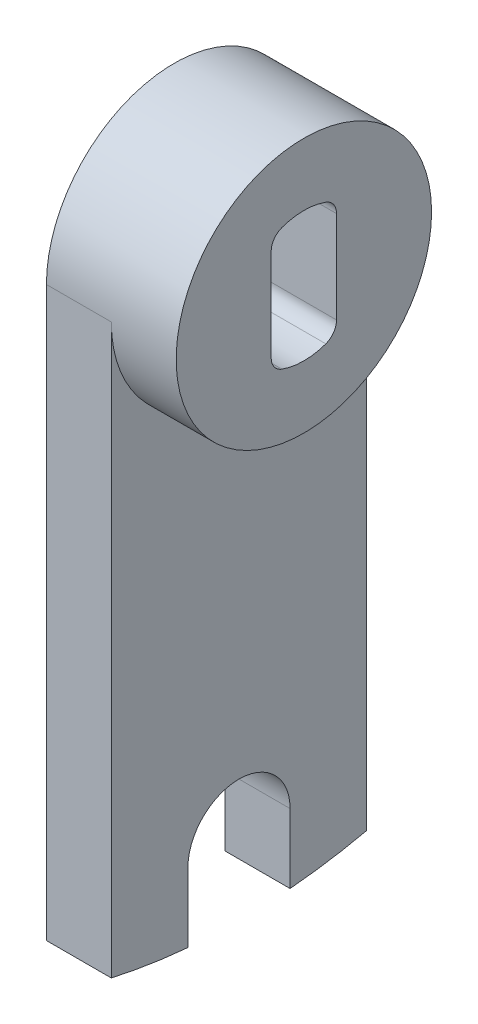
ISO-10303-21;
HEADER;
FILE_DESCRIPTION(('STEP AP214'),'2;1');
FILE_NAME('part.step','',(''),(''),'','','');
FILE_SCHEMA(('AUTOMOTIVE_DESIGN { 1 0 10303 214 1 1 1 1 }'));
ENDSEC;
DATA;
#1=APPLICATION_CONTEXT('core data for automotive mechanical design processes');
#2=APPLICATION_PROTOCOL_DEFINITION('international standard','automotive_design',2000,#1);
#3=PRODUCT_CONTEXT('',#1,'mechanical');
#4=PRODUCT('Part','Part','',(#3));
#5=PRODUCT_RELATED_PRODUCT_CATEGORY('part','',(#4));
#6=PRODUCT_DEFINITION_FORMATION('','',#4);
#7=PRODUCT_DEFINITION_CONTEXT('part definition',#1,'design');
#8=PRODUCT_DEFINITION('design','',#6,#7);
#9=PRODUCT_DEFINITION_SHAPE('','',#8);
#10=(LENGTH_UNIT() NAMED_UNIT(*) SI_UNIT(.MILLI.,.METRE.));
#11=(NAMED_UNIT(*) PLANE_ANGLE_UNIT() SI_UNIT($,.RADIAN.));
#12=(NAMED_UNIT(*) SI_UNIT($,.STERADIAN.) SOLID_ANGLE_UNIT());
#13=UNCERTAINTY_MEASURE_WITH_UNIT(LENGTH_MEASURE(1.E-05),#10,'distance_accuracy_value','');
#14=(GEOMETRIC_REPRESENTATION_CONTEXT(3) GLOBAL_UNCERTAINTY_ASSIGNED_CONTEXT((#13)) GLOBAL_UNIT_ASSIGNED_CONTEXT((#10,
#11,#12)) REPRESENTATION_CONTEXT('',''));
#15=CARTESIAN_POINT('',(0.,0.,0.));
#16=DIRECTION('',(0.,0.,1.));
#17=DIRECTION('',(1.,0.,0.));
#18=AXIS2_PLACEMENT_3D('',#15,#16,#17);
#19=CARTESIAN_POINT('',(3.175,0.,0.));
#20=DIRECTION('',(1.,0.,0.));
#21=DIRECTION('',(0.,0.,-1.));
#22=AXIS2_PLACEMENT_3D('',#19,#20,#21);
#23=PLANE('',#22);
#24=CARTESIAN_POINT('',(3.175,0.,0.));
#25=DIRECTION('',(1.,0.,0.));
#26=DIRECTION('',(0.,0.,-1.));
#27=AXIS2_PLACEMENT_3D('',#24,#25,#26);
#28=CIRCLE('',#27,12.5);
#29=CARTESIAN_POINT('',(3.175,0.,12.5));
#30=VERTEX_POINT('',#29);
#31=CARTESIAN_POINT('',(3.175,0.,-12.5));
#32=VERTEX_POINT('',#31);
#33=EDGE_CURVE('E159',#30,#32,#28,.T.);
#34=ORIENTED_EDGE('',*,*,#33,.F.);
#35=DIRECTION('',(0.,-1.,0.));
#36=VECTOR('',#35,1.);
#37=CARTESIAN_POINT('',(3.175,0.,12.5));
#38=LINE('',#37,#36);
#39=CARTESIAN_POINT('',(3.175,-55.6124985951899,12.5));
#40=VERTEX_POINT('',#39);
#41=EDGE_CURVE('E164',#30,#40,#38,.T.);
#42=ORIENTED_EDGE('',*,*,#41,.T.);
#43=CARTESIAN_POINT('',(3.175,0.,0.));
#44=DIRECTION('',(1.,0.,0.));
#45=DIRECTION('',(0.,0.,-1.));
#46=AXIS2_PLACEMENT_3D('',#43,#44,#45);
#47=CIRCLE('',#46,57.);
#48=CARTESIAN_POINT('',(3.175,-56.7802782663136,4.99999999999999));
#49=VERTEX_POINT('',#48);
#50=EDGE_CURVE('E222',#40,#49,#47,.T.);
#51=ORIENTED_EDGE('',*,*,#50,.T.);
#52=DIRECTION('',(0.,1.,0.));
#53=VECTOR('',#52,1.);
#54=CARTESIAN_POINT('',(3.175,-50.,4.99999999999999));
#55=LINE('',#54,#53);
#56=CARTESIAN_POINT('',(3.175,-50.,4.99999999999999));
#57=VERTEX_POINT('',#56);
#58=EDGE_CURVE('E220',#49,#57,#55,.T.);
#59=ORIENTED_EDGE('',*,*,#58,.T.);
#60=CARTESIAN_POINT('',(3.175,-50.,0.));
#61=DIRECTION('',(-1.,0.,0.));
#62=DIRECTION('',(0.,0.,-1.));
#63=AXIS2_PLACEMENT_3D('',#60,#61,#62);
#64=CIRCLE('',#63,5.);
#65=CARTESIAN_POINT('',(3.175,-50.,-5.));
#66=VERTEX_POINT('',#65);
#67=EDGE_CURVE('E218',#57,#66,#64,.T.);
#68=ORIENTED_EDGE('',*,*,#67,.T.);
#69=DIRECTION('',(0.,-1.,0.));
#70=VECTOR('',#69,1.);
#71=CARTESIAN_POINT('',(3.175,-50.,-5.00000000000001));
#72=LINE('',#71,#70);
#73=CARTESIAN_POINT('',(3.175,-56.7802782663136,-5.00000000000001));
#74=VERTEX_POINT('',#73);
#75=EDGE_CURVE('E199',#66,#74,#72,.T.);
#76=ORIENTED_EDGE('',*,*,#75,.T.);
#77=CARTESIAN_POINT('',(3.175,0.,0.));
#78=DIRECTION('',(1.,0.,0.));
#79=DIRECTION('',(0.,0.,-1.));
#80=AXIS2_PLACEMENT_3D('',#77,#78,#79);
#81=CIRCLE('',#80,57.);
#82=CARTESIAN_POINT('',(3.175,-55.6124985951899,-12.5));
#83=VERTEX_POINT('',#82);
#84=EDGE_CURVE('E162',#74,#83,#81,.T.);
#85=ORIENTED_EDGE('',*,*,#84,.T.);
#86=DIRECTION('',(0.,1.,0.));
#87=VECTOR('',#86,1.);
#88=CARTESIAN_POINT('',(3.175,0.,-12.5));
#89=LINE('',#88,#87);
#90=EDGE_CURVE('E149',#83,#32,#89,.T.);
#91=ORIENTED_EDGE('',*,*,#90,.T.);
#92=EDGE_LOOP('',(#34,#42,#51,#59,#68,#76,#85,#91));
#93=FACE_BOUND('',#92,.T.);
#94=ADVANCED_FACE('F32',(#93),#23,.T.);
#95=CARTESIAN_POINT('',(-3.175,0.,0.));
#96=DIRECTION('',(1.,0.,0.));
#97=DIRECTION('',(0.,0.,-1.));
#98=AXIS2_PLACEMENT_3D('',#95,#96,#97);
#99=PLANE('',#98);
#100=CARTESIAN_POINT('',(-3.175,0.,0.));
#101=DIRECTION('',(1.,0.,0.));
#102=DIRECTION('',(0.,0.,-1.));
#103=AXIS2_PLACEMENT_3D('',#100,#101,#102);
#104=CIRCLE('',#103,57.);
#105=CARTESIAN_POINT('',(-3.175,-56.7802782663136,-5.00000000000001));
#106=VERTEX_POINT('',#105);
#107=CARTESIAN_POINT('',(-3.175,-55.6124985951899,-12.5));
#108=VERTEX_POINT('',#107);
#109=EDGE_CURVE('E213',#106,#108,#104,.T.);
#110=ORIENTED_EDGE('',*,*,#109,.F.);
#111=DIRECTION('',(0.,-1.,0.));
#112=VECTOR('',#111,1.);
#113=CARTESIAN_POINT('',(-3.175,-50.,-5.00000000000001));
#114=LINE('',#113,#112);
#115=CARTESIAN_POINT('',(-3.175,-50.,-5.));
#116=VERTEX_POINT('',#115);
#117=EDGE_CURVE('E200',#116,#106,#114,.T.);
#118=ORIENTED_EDGE('',*,*,#117,.F.);
#119=CARTESIAN_POINT('',(-3.175,-50.,0.));
#120=DIRECTION('',(-1.,0.,0.));
#121=DIRECTION('',(0.,0.,-1.));
#122=AXIS2_PLACEMENT_3D('',#119,#120,#121);
#123=CIRCLE('',#122,5.);
#124=CARTESIAN_POINT('',(-3.175,-50.,4.99999999999999));
#125=VERTEX_POINT('',#124);
#126=EDGE_CURVE('E202',#125,#116,#123,.T.);
#127=ORIENTED_EDGE('',*,*,#126,.F.);
#128=DIRECTION('',(0.,1.,0.));
#129=VECTOR('',#128,1.);
#130=CARTESIAN_POINT('',(-3.175,-50.,4.99999999999999));
#131=LINE('',#130,#129);
#132=CARTESIAN_POINT('',(-3.175,-56.7802782663136,4.99999999999999));
#133=VERTEX_POINT('',#132);
#134=EDGE_CURVE('E204',#133,#125,#131,.T.);
#135=ORIENTED_EDGE('',*,*,#134,.F.);
#136=CARTESIAN_POINT('',(-3.175,0.,0.));
#137=DIRECTION('',(1.,0.,0.));
#138=DIRECTION('',(0.,0.,-1.));
#139=AXIS2_PLACEMENT_3D('',#136,#137,#138);
#140=CIRCLE('',#139,57.);
#141=CARTESIAN_POINT('',(-3.175,-55.6124985951899,12.5));
#142=VERTEX_POINT('',#141);
#143=EDGE_CURVE('E206',#142,#133,#140,.T.);
#144=ORIENTED_EDGE('',*,*,#143,.F.);
#145=DIRECTION('',(0.,-1.,0.));
#146=VECTOR('',#145,1.);
#147=CARTESIAN_POINT('',(-3.175,0.,12.5));
#148=LINE('',#147,#146);
#149=CARTESIAN_POINT('',(-3.175,0.,12.5));
#150=VERTEX_POINT('',#149);
#151=EDGE_CURVE('E208',#150,#142,#148,.T.);
#152=ORIENTED_EDGE('',*,*,#151,.F.);
#153=CARTESIAN_POINT('',(-3.175,0.,0.));
#154=DIRECTION('',(1.,0.,0.));
#155=DIRECTION('',(0.,0.,-1.));
#156=AXIS2_PLACEMENT_3D('',#153,#154,#155);
#157=CIRCLE('',#156,12.5);
#158=CARTESIAN_POINT('',(-3.175,0.,-12.5));
#159=VERTEX_POINT('',#158);
#160=EDGE_CURVE('E210',#159,#150,#157,.T.);
#161=ORIENTED_EDGE('',*,*,#160,.F.);
#162=DIRECTION('',(0.,1.,0.));
#163=VECTOR('',#162,1.);
#164=CARTESIAN_POINT('',(-3.175,0.,-12.5));
#165=LINE('',#164,#163);
#166=EDGE_CURVE('E151',#108,#159,#165,.T.);
#167=ORIENTED_EDGE('',*,*,#166,.F.);
#168=EDGE_LOOP('',(#110,#118,#127,#135,#144,#152,#161,#167));
#169=FACE_BOUND('',#168,.T.);
#170=DIRECTION('',(0.,1.,0.));
#171=VECTOR('',#170,1.);
#172=CARTESIAN_POINT('',(-3.175,5.51390650990747,-3.2004));
#173=LINE('',#172,#171);
#174=CARTESIAN_POINT('',(-3.175,-4.50805279472191,-3.2004));
#175=VERTEX_POINT('',#174);
#176=CARTESIAN_POINT('',(-3.175,4.50805279472191,-3.2004));
#177=VERTEX_POINT('',#176);
#178=EDGE_CURVE('E216',#175,#177,#173,.T.);
#179=ORIENTED_EDGE('',*,*,#178,.T.);
#180=CARTESIAN_POINT('',(-3.175,4.50805279472191,-1.6129));
#181=DIRECTION('',(1.,0.,0.));
#182=DIRECTION('',(0.,0.,-1.));
#183=AXIS2_PLACEMENT_3D('',#180,#181,#182);
#184=CIRCLE('',#183,1.5875);
#185=CARTESIAN_POINT('',(-3.175,6.00276525981538,-2.14768116710875));
#186=VERTEX_POINT('',#185);
#187=EDGE_CURVE('E40',#177,#186,#184,.T.);
#188=ORIENTED_EDGE('',*,*,#187,.T.);
#189=CARTESIAN_POINT('',(-3.175,0.,0.));
#190=DIRECTION('',(1.,0.,0.));
#191=DIRECTION('',(0.,0.,-1.));
#192=AXIS2_PLACEMENT_3D('',#189,#190,#191);
#193=CIRCLE('',#192,6.3754);
#194=CARTESIAN_POINT('',(-3.175,6.00276525981538,2.14768116710875));
#195=VERTEX_POINT('',#194);
#196=EDGE_CURVE('E233',#186,#195,#193,.T.);
#197=ORIENTED_EDGE('',*,*,#196,.T.);
#198=CARTESIAN_POINT('',(-3.175,4.50805279472191,1.6129));
#199=DIRECTION('',(1.,0.,0.));
#200=DIRECTION('',(0.,0.,-1.));
#201=AXIS2_PLACEMENT_3D('',#198,#199,#200);
#202=CIRCLE('',#201,1.5875);
#203=CARTESIAN_POINT('',(-3.175,4.50805279472191,3.2004));
#204=VERTEX_POINT('',#203);
#205=EDGE_CURVE('E257',#195,#204,#202,.T.);
#206=ORIENTED_EDGE('',*,*,#205,.T.);
#207=DIRECTION('',(0.,-1.,0.));
#208=VECTOR('',#207,1.);
#209=CARTESIAN_POINT('',(-3.175,5.51390650990747,3.2004));
#210=LINE('',#209,#208);
#211=CARTESIAN_POINT('',(-3.175,-4.50805279472191,3.2004));
#212=VERTEX_POINT('',#211);
#213=EDGE_CURVE('E230',#204,#212,#210,.T.);
#214=ORIENTED_EDGE('',*,*,#213,.T.);
#215=CARTESIAN_POINT('',(-3.175,-4.50805279472191,1.6129));
#216=DIRECTION('',(1.,0.,0.));
#217=DIRECTION('',(0.,0.,-1.));
#218=AXIS2_PLACEMENT_3D('',#215,#216,#217);
#219=CIRCLE('',#218,1.5875);
#220=CARTESIAN_POINT('',(-3.175,-6.00276525981538,2.14768116710875));
#221=VERTEX_POINT('',#220);
#222=EDGE_CURVE('E258',#212,#221,#219,.T.);
#223=ORIENTED_EDGE('',*,*,#222,.T.);
#224=CARTESIAN_POINT('',(-3.175,0.,0.));
#225=DIRECTION('',(1.,0.,0.));
#226=DIRECTION('',(0.,0.,-1.));
#227=AXIS2_PLACEMENT_3D('',#224,#225,#226);
#228=CIRCLE('',#227,6.3754);
#229=CARTESIAN_POINT('',(-3.175,-6.00276525981538,-2.14768116710875));
#230=VERTEX_POINT('',#229);
#231=EDGE_CURVE('E227',#221,#230,#228,.T.);
#232=ORIENTED_EDGE('',*,*,#231,.T.);
#233=CARTESIAN_POINT('',(-3.175,-4.50805279472191,-1.6129));
#234=DIRECTION('',(1.,0.,0.));
#235=DIRECTION('',(0.,0.,-1.));
#236=AXIS2_PLACEMENT_3D('',#233,#234,#235);
#237=CIRCLE('',#236,1.5875);
#238=EDGE_CURVE('E267',#230,#175,#237,.T.);
#239=ORIENTED_EDGE('',*,*,#238,.T.);
#240=EDGE_LOOP('',(#179,#188,#197,#206,#214,#223,#232,#239));
#241=FACE_BOUND('',#240,.T.);
#242=ADVANCED_FACE('F273',(#169,#241),#99,.F.);
#243=CARTESIAN_POINT('',(3.175,0.,0.));
#244=DIRECTION('',(-1.,0.,0.));
#245=DIRECTION('',(0.,0.,1.));
#246=AXIS2_PLACEMENT_3D('',#243,#244,#245);
#247=CYLINDRICAL_SURFACE('',#246,57.);
#248=ORIENTED_EDGE('',*,*,#109,.T.);
#249=DIRECTION('',(-1.,0.,0.));
#250=VECTOR('',#249,1.);
#251=CARTESIAN_POINT('',(3.175,-55.6124985951899,-12.5));
#252=LINE('',#251,#250);
#253=EDGE_CURVE('E155',#83,#108,#252,.T.);
#254=ORIENTED_EDGE('',*,*,#253,.F.);
#255=ORIENTED_EDGE('',*,*,#84,.F.);
#256=DIRECTION('',(-1.,0.,0.));
#257=VECTOR('',#256,1.);
#258=CARTESIAN_POINT('',(3.175,-56.7802782663136,-5.00000000000001));
#259=LINE('',#258,#257);
#260=EDGE_CURVE('E196',#74,#106,#259,.T.);
#261=ORIENTED_EDGE('',*,*,#260,.T.);
#262=EDGE_LOOP('',(#248,#254,#255,#261));
#263=FACE_BOUND('',#262,.T.);
#264=ADVANCED_FACE('F324',(#263),#247,.T.);
#265=CARTESIAN_POINT('',(3.175,0.,-12.5));
#266=DIRECTION('',(0.,0.,1.));
#267=DIRECTION('',(0.,-1.,0.));
#268=AXIS2_PLACEMENT_3D('',#265,#266,#267);
#269=PLANE('',#268);
#270=ORIENTED_EDGE('',*,*,#166,.T.);
#271=DIRECTION('',(-1.,0.,0.));
#272=VECTOR('',#271,1.);
#273=CARTESIAN_POINT('',(3.175,0.,-12.5));
#274=LINE('',#273,#272);
#275=EDGE_CURVE('E145',#32,#159,#274,.T.);
#276=ORIENTED_EDGE('',*,*,#275,.F.);
#277=ORIENTED_EDGE('',*,*,#90,.F.);
#278=ORIENTED_EDGE('',*,*,#253,.T.);
#279=EDGE_LOOP('',(#270,#276,#277,#278));
#280=FACE_BOUND('',#279,.T.);
#281=ADVANCED_FACE('F147',(#280),#269,.F.);
#282=CARTESIAN_POINT('',(3.175,0.,0.));
#283=DIRECTION('',(-1.,0.,0.));
#284=DIRECTION('',(0.,0.,1.));
#285=AXIS2_PLACEMENT_3D('',#282,#283,#284);
#286=CYLINDRICAL_SURFACE('',#285,12.5);
#287=ORIENTED_EDGE('',*,*,#160,.T.);
#288=DIRECTION('',(-1.,0.,0.));
#289=VECTOR('',#288,1.);
#290=CARTESIAN_POINT('',(3.175,0.,12.5));
#291=LINE('',#290,#289);
#292=EDGE_CURVE('E156',#30,#150,#291,.T.);
#293=ORIENTED_EDGE('',*,*,#292,.F.);
#294=ORIENTED_EDGE('',*,*,#33,.T.);
#295=ORIENTED_EDGE('',*,*,#275,.T.);
#296=EDGE_LOOP('',(#287,#293,#294,#295));
#297=FACE_BOUND('',#296,.T.);
#298=CARTESIAN_POINT('',(9.525,0.,0.));
#299=DIRECTION('',(1.,0.,0.));
#300=DIRECTION('',(0.,0.,-1.));
#301=AXIS2_PLACEMENT_3D('',#298,#299,#300);
#302=CIRCLE('',#301,12.5);
#303=CARTESIAN_POINT('',(9.525,0.,-12.5));
#304=VERTEX_POINT('',#303);
#305=EDGE_CURVE('E236',#304,#304,#302,.T.);
#306=ORIENTED_EDGE('',*,*,#305,.F.);
#307=EDGE_LOOP('',(#306));
#308=FACE_BOUND('',#307,.T.);
#309=ADVANCED_FACE('F166',(#297,#308),#286,.T.);
#310=CARTESIAN_POINT('',(3.175,0.,12.5));
#311=DIRECTION('',(0.,0.,-1.));
#312=DIRECTION('',(0.,1.,0.));
#313=AXIS2_PLACEMENT_3D('',#310,#311,#312);
#314=PLANE('',#313);
#315=ORIENTED_EDGE('',*,*,#151,.T.);
#316=DIRECTION('',(-1.,0.,0.));
#317=VECTOR('',#316,1.);
#318=CARTESIAN_POINT('',(3.175,-55.6124985951899,12.5));
#319=LINE('',#318,#317);
#320=EDGE_CURVE('E184',#40,#142,#319,.T.);
#321=ORIENTED_EDGE('',*,*,#320,.F.);
#322=ORIENTED_EDGE('',*,*,#41,.F.);
#323=ORIENTED_EDGE('',*,*,#292,.T.);
#324=EDGE_LOOP('',(#315,#321,#322,#323));
#325=FACE_BOUND('',#324,.T.);
#326=ADVANCED_FACE('F302',(#325),#314,.F.);
#327=CARTESIAN_POINT('',(3.175,0.,0.));
#328=DIRECTION('',(-1.,0.,0.));
#329=DIRECTION('',(0.,0.,1.));
#330=AXIS2_PLACEMENT_3D('',#327,#328,#329);
#331=CYLINDRICAL_SURFACE('',#330,57.);
#332=ORIENTED_EDGE('',*,*,#143,.T.);
#333=DIRECTION('',(-1.,0.,0.));
#334=VECTOR('',#333,1.);
#335=CARTESIAN_POINT('',(3.175,-56.7802782663136,4.99999999999999));
#336=LINE('',#335,#334);
#337=EDGE_CURVE('E187',#49,#133,#336,.T.);
#338=ORIENTED_EDGE('',*,*,#337,.F.);
#339=ORIENTED_EDGE('',*,*,#50,.F.);
#340=ORIENTED_EDGE('',*,*,#320,.T.);
#341=EDGE_LOOP('',(#332,#338,#339,#340));
#342=FACE_BOUND('',#341,.T.);
#343=ADVANCED_FACE('F306',(#342),#331,.T.);
#344=CARTESIAN_POINT('',(3.175,-50.,4.99999999999999));
#345=DIRECTION('',(0.,0.,1.));
#346=DIRECTION('',(0.,-1.,0.));
#347=AXIS2_PLACEMENT_3D('',#344,#345,#346);
#348=PLANE('',#347);
#349=ORIENTED_EDGE('',*,*,#134,.T.);
#350=DIRECTION('',(-1.,0.,0.));
#351=VECTOR('',#350,1.);
#352=CARTESIAN_POINT('',(3.175,-50.,4.99999999999999));
#353=LINE('',#352,#351);
#354=EDGE_CURVE('E190',#57,#125,#353,.T.);
#355=ORIENTED_EDGE('',*,*,#354,.F.);
#356=ORIENTED_EDGE('',*,*,#58,.F.);
#357=ORIENTED_EDGE('',*,*,#337,.T.);
#358=EDGE_LOOP('',(#349,#355,#356,#357));
#359=FACE_BOUND('',#358,.T.);
#360=ADVANCED_FACE('F311',(#359),#348,.F.);
#361=CARTESIAN_POINT('',(3.175,-50.,0.));
#362=DIRECTION('',(-1.,0.,0.));
#363=DIRECTION('',(0.,0.,1.));
#364=AXIS2_PLACEMENT_3D('',#361,#362,#363);
#365=CYLINDRICAL_SURFACE('',#364,5.);
#366=ORIENTED_EDGE('',*,*,#126,.T.);
#367=DIRECTION('',(-1.,0.,0.));
#368=VECTOR('',#367,1.);
#369=CARTESIAN_POINT('',(3.175,-50.,-5.));
#370=LINE('',#369,#368);
#371=EDGE_CURVE('E193',#66,#116,#370,.T.);
#372=ORIENTED_EDGE('',*,*,#371,.F.);
#373=ORIENTED_EDGE('',*,*,#67,.F.);
#374=ORIENTED_EDGE('',*,*,#354,.T.);
#375=EDGE_LOOP('',(#366,#372,#373,#374));
#376=FACE_BOUND('',#375,.T.);
#377=ADVANCED_FACE('F317',(#376),#365,.F.);
#378=CARTESIAN_POINT('',(3.175,-50.,-5.00000000000001));
#379=DIRECTION('',(0.,0.,-1.));
#380=DIRECTION('',(0.,1.,0.));
#381=AXIS2_PLACEMENT_3D('',#378,#379,#380);
#382=PLANE('',#381);
#383=ORIENTED_EDGE('',*,*,#117,.T.);
#384=ORIENTED_EDGE('',*,*,#260,.F.);
#385=ORIENTED_EDGE('',*,*,#75,.F.);
#386=ORIENTED_EDGE('',*,*,#371,.T.);
#387=EDGE_LOOP('',(#383,#384,#385,#386));
#388=FACE_BOUND('',#387,.T.);
#389=ADVANCED_FACE('F321',(#388),#382,.F.);
#390=CARTESIAN_POINT('',(3.175,0.,0.));
#391=DIRECTION('',(-1.,0.,0.));
#392=DIRECTION('',(0.,0.,1.));
#393=AXIS2_PLACEMENT_3D('',#390,#391,#392);
#394=CYLINDRICAL_SURFACE('',#393,6.3754);
#395=CARTESIAN_POINT('',(9.525,0.,0.));
#396=DIRECTION('',(1.,0.,0.));
#397=DIRECTION('',(0.,0.,-1.));
#398=AXIS2_PLACEMENT_3D('',#395,#396,#397);
#399=CIRCLE('',#398,6.3754);
#400=CARTESIAN_POINT('',(9.525,6.00276525981538,-2.14768116710875));
#401=VERTEX_POINT('',#400);
#402=CARTESIAN_POINT('',(9.525,6.00276525981538,2.14768116710875));
#403=VERTEX_POINT('',#402);
#404=EDGE_CURVE('E248',#401,#403,#399,.T.);
#405=ORIENTED_EDGE('',*,*,#404,.T.);
#406=DIRECTION('',(-1.,0.,0.));
#407=VECTOR('',#406,1.);
#408=CARTESIAN_POINT('',(3.175,6.00276525981538,2.14768116710875));
#409=LINE('',#408,#407);
#410=EDGE_CURVE('E252',#403,#195,#409,.T.);
#411=ORIENTED_EDGE('',*,*,#410,.T.);
#412=ORIENTED_EDGE('',*,*,#196,.F.);
#413=DIRECTION('',(-1.,0.,0.));
#414=VECTOR('',#413,1.);
#415=CARTESIAN_POINT('',(3.175,6.00276525981538,-2.14768116710875));
#416=LINE('',#415,#414);
#417=EDGE_CURVE('E54',#186,#401,#416,.F.);
#418=ORIENTED_EDGE('',*,*,#417,.T.);
#419=EDGE_LOOP('',(#405,#411,#412,#418));
#420=FACE_BOUND('',#419,.T.);
#421=ADVANCED_FACE('F251',(#420),#394,.F.);
#422=CARTESIAN_POINT('',(3.175,5.51390650990747,3.2004));
#423=DIRECTION('',(0.,0.,-1.));
#424=DIRECTION('',(-1.,0.,0.));
#425=AXIS2_PLACEMENT_3D('',#422,#423,#424);
#426=PLANE('',#425);
#427=DIRECTION('',(0.,-1.,0.));
#428=VECTOR('',#427,1.);
#429=CARTESIAN_POINT('',(9.525,5.51390650990747,3.2004));
#430=LINE('',#429,#428);
#431=CARTESIAN_POINT('',(9.525,4.50805279472191,3.2004));
#432=VERTEX_POINT('',#431);
#433=CARTESIAN_POINT('',(9.525,-4.50805279472191,3.2004));
#434=VERTEX_POINT('',#433);
#435=EDGE_CURVE('E245',#432,#434,#430,.T.);
#436=ORIENTED_EDGE('',*,*,#435,.T.);
#437=DIRECTION('',(1.,0.,0.));
#438=VECTOR('',#437,1.);
#439=CARTESIAN_POINT('',(-3.175,-4.50805279472191,3.2004));
#440=LINE('',#439,#438);
#441=EDGE_CURVE('E172',#434,#212,#440,.F.);
#442=ORIENTED_EDGE('',*,*,#441,.T.);
#443=ORIENTED_EDGE('',*,*,#213,.F.);
#444=DIRECTION('',(1.,0.,0.));
#445=VECTOR('',#444,1.);
#446=CARTESIAN_POINT('',(9.525,4.50805279472191,3.2004));
#447=LINE('',#446,#445);
#448=EDGE_CURVE('E170',#204,#432,#447,.T.);
#449=ORIENTED_EDGE('',*,*,#448,.T.);
#450=EDGE_LOOP('',(#436,#442,#443,#449));
#451=FACE_BOUND('',#450,.T.);
#452=ADVANCED_FACE('F406',(#451),#426,.T.);
#453=CARTESIAN_POINT('',(3.175,0.,0.));
#454=DIRECTION('',(-1.,0.,0.));
#455=DIRECTION('',(0.,0.,1.));
#456=AXIS2_PLACEMENT_3D('',#453,#454,#455);
#457=CYLINDRICAL_SURFACE('',#456,6.3754);
#458=ORIENTED_EDGE('',*,*,#231,.F.);
#459=DIRECTION('',(-1.,0.,0.));
#460=VECTOR('',#459,1.);
#461=CARTESIAN_POINT('',(3.175,-6.00276525981538,2.14768116710875));
#462=LINE('',#461,#460);
#463=CARTESIAN_POINT('',(9.525,-6.00276525981538,2.14768116710875));
#464=VERTEX_POINT('',#463);
#465=EDGE_CURVE('E286',#221,#464,#462,.F.);
#466=ORIENTED_EDGE('',*,*,#465,.T.);
#467=CARTESIAN_POINT('',(9.525,0.,0.));
#468=DIRECTION('',(1.,0.,0.));
#469=DIRECTION('',(0.,0.,-1.));
#470=AXIS2_PLACEMENT_3D('',#467,#468,#469);
#471=CIRCLE('',#470,6.3754);
#472=CARTESIAN_POINT('',(9.525,-6.00276525981538,-2.14768116710875));
#473=VERTEX_POINT('',#472);
#474=EDGE_CURVE('E242',#464,#473,#471,.T.);
#475=ORIENTED_EDGE('',*,*,#474,.T.);
#476=DIRECTION('',(-1.,0.,0.));
#477=VECTOR('',#476,1.);
#478=CARTESIAN_POINT('',(3.175,-6.00276525981538,-2.14768116710875));
#479=LINE('',#478,#477);
#480=EDGE_CURVE('E290',#473,#230,#479,.T.);
#481=ORIENTED_EDGE('',*,*,#480,.T.);
#482=EDGE_LOOP('',(#458,#466,#475,#481));
#483=FACE_BOUND('',#482,.T.);
#484=ADVANCED_FACE('F396',(#483),#457,.F.);
#485=CARTESIAN_POINT('',(3.175,5.51390650990747,-3.2004));
#486=DIRECTION('',(0.,0.,1.));
#487=DIRECTION('',(1.,0.,0.));
#488=AXIS2_PLACEMENT_3D('',#485,#486,#487);
#489=PLANE('',#488);
#490=ORIENTED_EDGE('',*,*,#178,.F.);
#491=DIRECTION('',(1.,0.,0.));
#492=VECTOR('',#491,1.);
#493=CARTESIAN_POINT('',(9.525,-4.50805279472191,-3.2004));
#494=LINE('',#493,#492);
#495=CARTESIAN_POINT('',(9.525,-4.50805279472191,-3.2004));
#496=VERTEX_POINT('',#495);
#497=EDGE_CURVE('E262',#175,#496,#494,.T.);
#498=ORIENTED_EDGE('',*,*,#497,.T.);
#499=DIRECTION('',(0.,1.,0.));
#500=VECTOR('',#499,1.);
#501=CARTESIAN_POINT('',(9.525,-5.51390650990747,-3.2004));
#502=LINE('',#501,#500);
#503=CARTESIAN_POINT('',(9.525,4.50805279472191,-3.2004));
#504=VERTEX_POINT('',#503);
#505=EDGE_CURVE('E239',#496,#504,#502,.T.);
#506=ORIENTED_EDGE('',*,*,#505,.T.);
#507=DIRECTION('',(1.,0.,0.));
#508=VECTOR('',#507,1.);
#509=CARTESIAN_POINT('',(-3.175,4.50805279472191,-3.2004));
#510=LINE('',#509,#508);
#511=EDGE_CURVE('E278',#504,#177,#510,.F.);
#512=ORIENTED_EDGE('',*,*,#511,.T.);
#513=EDGE_LOOP('',(#490,#498,#506,#512));
#514=FACE_BOUND('',#513,.T.);
#515=ADVANCED_FACE('F283',(#514),#489,.T.);
#516=CARTESIAN_POINT('',(9.525,0.,0.));
#517=DIRECTION('',(1.,0.,0.));
#518=DIRECTION('',(0.,0.,-1.));
#519=AXIS2_PLACEMENT_3D('',#516,#517,#518);
#520=PLANE('',#519);
#521=ORIENTED_EDGE('',*,*,#305,.T.);
#522=EDGE_LOOP('',(#521));
#523=FACE_BOUND('',#522,.T.);
#524=ORIENTED_EDGE('',*,*,#435,.F.);
#525=CARTESIAN_POINT('',(9.525,4.50805279472191,1.6129));
#526=DIRECTION('',(1.,0.,0.));
#527=DIRECTION('',(0.,0.,-1.));
#528=AXIS2_PLACEMENT_3D('',#525,#526,#527);
#529=CIRCLE('',#528,1.5875);
#530=EDGE_CURVE('E47',#432,#403,#529,.F.);
#531=ORIENTED_EDGE('',*,*,#530,.T.);
#532=ORIENTED_EDGE('',*,*,#404,.F.);
#533=CARTESIAN_POINT('',(9.525,4.50805279472191,-1.6129));
#534=DIRECTION('',(1.,0.,0.));
#535=DIRECTION('',(0.,0.,-1.));
#536=AXIS2_PLACEMENT_3D('',#533,#534,#535);
#537=CIRCLE('',#536,1.5875);
#538=EDGE_CURVE('E11',#401,#504,#537,.F.);
#539=ORIENTED_EDGE('',*,*,#538,.T.);
#540=ORIENTED_EDGE('',*,*,#505,.F.);
#541=CARTESIAN_POINT('',(9.525,-4.50805279472191,-1.6129));
#542=DIRECTION('',(1.,0.,0.));
#543=DIRECTION('',(0.,0.,-1.));
#544=AXIS2_PLACEMENT_3D('',#541,#542,#543);
#545=CIRCLE('',#544,1.5875);
#546=EDGE_CURVE('E269',#496,#473,#545,.F.);
#547=ORIENTED_EDGE('',*,*,#546,.T.);
#548=ORIENTED_EDGE('',*,*,#474,.F.);
#549=CARTESIAN_POINT('',(9.525,-4.50805279472191,1.6129));
#550=DIRECTION('',(1.,0.,0.));
#551=DIRECTION('',(0.,0.,-1.));
#552=AXIS2_PLACEMENT_3D('',#549,#550,#551);
#553=CIRCLE('',#552,1.5875);
#554=EDGE_CURVE('E260',#464,#434,#553,.F.);
#555=ORIENTED_EDGE('',*,*,#554,.T.);
#556=EDGE_LOOP('',(#524,#531,#532,#539,#540,#547,#548,#555));
#557=FACE_BOUND('',#556,.T.);
#558=ADVANCED_FACE('F280',(#523,#557),#520,.T.);
#559=CARTESIAN_POINT('',(3.175,-4.50805279472191,1.6129));
#560=DIRECTION('',(-1.,0.,0.));
#561=DIRECTION('',(0.,0.,1.));
#562=AXIS2_PLACEMENT_3D('',#559,#560,#561);
#563=CYLINDRICAL_SURFACE('',#562,1.5875);
#564=ORIENTED_EDGE('',*,*,#554,.F.);
#565=ORIENTED_EDGE('',*,*,#465,.F.);
#566=ORIENTED_EDGE('',*,*,#222,.F.);
#567=ORIENTED_EDGE('',*,*,#441,.F.);
#568=EDGE_LOOP('',(#564,#565,#566,#567));
#569=FACE_BOUND('',#568,.T.);
#570=ADVANCED_FACE('F350',(#569),#563,.F.);
#571=CARTESIAN_POINT('',(3.175,-4.50805279472191,-1.6129));
#572=DIRECTION('',(-1.,0.,0.));
#573=DIRECTION('',(0.,0.,1.));
#574=AXIS2_PLACEMENT_3D('',#571,#572,#573);
#575=CYLINDRICAL_SURFACE('',#574,1.5875);
#576=ORIENTED_EDGE('',*,*,#546,.F.);
#577=ORIENTED_EDGE('',*,*,#497,.F.);
#578=ORIENTED_EDGE('',*,*,#238,.F.);
#579=ORIENTED_EDGE('',*,*,#480,.F.);
#580=EDGE_LOOP('',(#576,#577,#578,#579));
#581=FACE_BOUND('',#580,.T.);
#582=ADVANCED_FACE('F353',(#581),#575,.F.);
#583=CARTESIAN_POINT('',(3.175,4.50805279472191,1.6129));
#584=DIRECTION('',(-1.,0.,0.));
#585=DIRECTION('',(0.,0.,1.));
#586=AXIS2_PLACEMENT_3D('',#583,#584,#585);
#587=CYLINDRICAL_SURFACE('',#586,1.5875);
#588=ORIENTED_EDGE('',*,*,#530,.F.);
#589=ORIENTED_EDGE('',*,*,#448,.F.);
#590=ORIENTED_EDGE('',*,*,#205,.F.);
#591=ORIENTED_EDGE('',*,*,#410,.F.);
#592=EDGE_LOOP('',(#588,#589,#590,#591));
#593=FACE_BOUND('',#592,.T.);
#594=ADVANCED_FACE('F255',(#593),#587,.F.);
#595=CARTESIAN_POINT('',(3.175,4.50805279472191,-1.6129));
#596=DIRECTION('',(-1.,0.,0.));
#597=DIRECTION('',(0.,0.,1.));
#598=AXIS2_PLACEMENT_3D('',#595,#596,#597);
#599=CYLINDRICAL_SURFACE('',#598,1.5875);
#600=ORIENTED_EDGE('',*,*,#538,.F.);
#601=ORIENTED_EDGE('',*,*,#417,.F.);
#602=ORIENTED_EDGE('',*,*,#187,.F.);
#603=ORIENTED_EDGE('',*,*,#511,.F.);
#604=EDGE_LOOP('',(#600,#601,#602,#603));
#605=FACE_BOUND('',#604,.T.);
#606=ADVANCED_FACE('F34',(#605),#599,.F.);
#607=CLOSED_SHELL('',(#94,#242,#264,#281,#309,#326,#343,#360,#377,#389,#421,#452,#484,#515,#558,
#570,#582,#594,#606));
#608=MANIFOLD_SOLID_BREP('B2',#607);
#609=ADVANCED_BREP_SHAPE_REPRESENTATION('',(#18,#608),#14);
#610=SHAPE_DEFINITION_REPRESENTATION(#9,#609);
ENDSEC;
END-ISO-10303-21;
